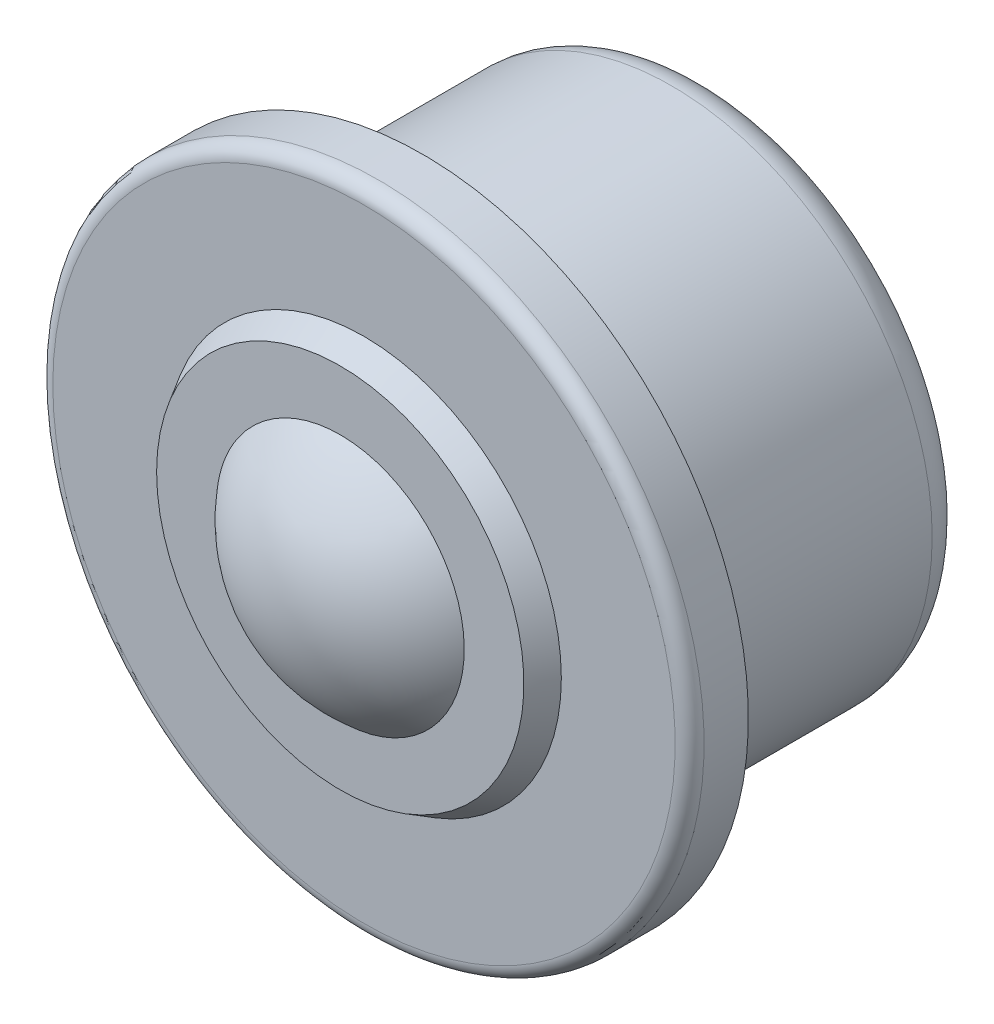
ISO-10303-21;
HEADER;
FILE_DESCRIPTION(('STEP AP214'),'2;1');
FILE_NAME('part.step','',(''),(''),'','','');
FILE_SCHEMA(('AUTOMOTIVE_DESIGN { 1 0 10303 214 1 1 1 1 }'));
ENDSEC;
DATA;
#1=APPLICATION_CONTEXT('core data for automotive mechanical design processes');
#2=APPLICATION_PROTOCOL_DEFINITION('international standard','automotive_design',2000,#1);
#3=PRODUCT_CONTEXT('',#1,'mechanical');
#4=PRODUCT('Part','Part','',(#3));
#5=PRODUCT_RELATED_PRODUCT_CATEGORY('part','',(#4));
#6=PRODUCT_DEFINITION_FORMATION('','',#4);
#7=PRODUCT_DEFINITION_CONTEXT('part definition',#1,'design');
#8=PRODUCT_DEFINITION('design','',#6,#7);
#9=PRODUCT_DEFINITION_SHAPE('','',#8);
#10=(LENGTH_UNIT() NAMED_UNIT(*) SI_UNIT(.MILLI.,.METRE.));
#11=(NAMED_UNIT(*) PLANE_ANGLE_UNIT() SI_UNIT($,.RADIAN.));
#12=(NAMED_UNIT(*) SI_UNIT($,.STERADIAN.) SOLID_ANGLE_UNIT());
#13=UNCERTAINTY_MEASURE_WITH_UNIT(LENGTH_MEASURE(1.E-05),#10,'distance_accuracy_value','');
#14=(GEOMETRIC_REPRESENTATION_CONTEXT(3) GLOBAL_UNCERTAINTY_ASSIGNED_CONTEXT((#13)) GLOBAL_UNIT_ASSIGNED_CONTEXT((#10,
#11,#12)) REPRESENTATION_CONTEXT('',''));
#15=CARTESIAN_POINT('',(0.,0.,0.));
#16=DIRECTION('',(0.,0.,1.));
#17=DIRECTION('',(1.,0.,0.));
#18=AXIS2_PLACEMENT_3D('',#15,#16,#17);
#19=CARTESIAN_POINT('',(0.,0.,-1.19999998087211));
#20=DIRECTION('',(1.,0.,0.));
#21=DIRECTION('',(0.,1.,0.));
#22=AXIS2_PLACEMENT_3D('',#19,#20,#21);
#23=SPHERICAL_SURFACE('',#22,10.9999999867639);
#24=CARTESIAN_POINT('',(-8.56679636578171,0.,5.7));
#25=CARTESIAN_POINT('',(-8.5667980927726,0.240686989194574,5.7));
#26=CARTESIAN_POINT('',(-8.55664892448667,0.481345637660275,5.7));
#27=CARTESIAN_POINT('',(-8.51612310031646,0.96103270341007,5.7));
#28=CARTESIAN_POINT('',(-8.48574112305501,1.20006067510178,5.7));
#29=CARTESIAN_POINT('',(-8.40491488099617,1.67495927640874,5.7));
#30=CARTESIAN_POINT('',(-8.35444920988333,1.91082625869168,5.7));
#31=CARTESIAN_POINT('',(-8.23381496574094,2.37747078518052,5.7));
#32=CARTESIAN_POINT('',(-8.1636461553905,2.60824826804819,5.7));
#33=CARTESIAN_POINT('',(-8.00414451829029,3.06295483504364,5.7));
#34=CARTESIAN_POINT('',(-7.91482113713638,3.28688723269123,5.7));
#35=CARTESIAN_POINT('',(-7.71762360518375,3.72643375455393,5.7));
#36=CARTESIAN_POINT('',(-7.60974916146404,3.94204774735571,5.7));
#37=CARTESIAN_POINT('',(-7.37626788650457,4.36332960347386,5.7));
#38=CARTESIAN_POINT('',(-7.25066869691487,4.56900170199427,5.7));
#39=CARTESIAN_POINT('',(-6.98254890542435,4.96910694620137,5.7));
#40=CARTESIAN_POINT('',(-6.84002246132505,5.16353617694795,5.7));
#41=CARTESIAN_POINT('',(-6.53910776918052,5.53968175816775,5.7));
#42=CARTESIAN_POINT('',(-6.38072072762854,5.72139907383491,5.7));
#43=CARTESIAN_POINT('',(-6.04919916779965,6.0708480101663,5.7));
#44=CARTESIAN_POINT('',(-5.87606441924627,6.23857941236805,5.7));
#45=CARTESIAN_POINT('',(-5.51627675919145,6.55886417473872,5.7));
#46=CARTESIAN_POINT('',(-5.32962357095064,6.71141722403593,5.7));
#47=CARTESIAN_POINT('',(-4.94412489085363,7.00026000508106,5.7));
#48=CARTESIAN_POINT('',(-4.7452791297642,7.13654937750277,5.7));
#49=CARTESIAN_POINT('',(-4.33685429146332,7.3918659666588,5.7));
#50=CARTESIAN_POINT('',(-4.12727739891287,7.51089667818132,5.7));
#51=CARTESIAN_POINT('',(-3.69876837103764,7.73092104501002,5.7));
#52=CARTESIAN_POINT('',(-3.47983302183353,7.83190844120192,5.7));
#53=CARTESIAN_POINT('',(-3.03427276242032,8.01506053474282,5.7));
#54=CARTESIAN_POINT('',(-2.80764926554908,8.0972286704017,5.7));
#55=CARTESIAN_POINT('',(-2.34828226491216,8.24218288418291,5.7));
#56=CARTESIAN_POINT('',(-2.1155386659324,8.30496866056846,5.7));
#57=CARTESIAN_POINT('',(-1.64559355233376,8.41070913986245,5.7));
#58=CARTESIAN_POINT('',(-1.40839211323019,8.45366417838674,5.7));
#59=CARTESIAN_POINT('',(-0.931208502606138,8.51944010015609,5.7));
#60=CARTESIAN_POINT('',(-0.69122626974022,8.54226053836367,5.7));
#61=CARTESIAN_POINT('',(-0.21023721583198,8.56760104720299,5.7));
#62=CARTESIAN_POINT('',(0.0307694064026644,8.5701248916721,5.70000000000001));
#63=CARTESIAN_POINT('',(0.512222262264283,8.55486153016511,5.7));
#64=CARTESIAN_POINT('',(0.752668272977411,8.53706729159761,5.69999999999999));
#65=CARTESIAN_POINT('',(1.23116275026479,8.48128792752323,5.69999999999999));
#66=CARTESIAN_POINT('',(1.46921164167782,8.44330644631576,5.7));
#67=CARTESIAN_POINT('',(1.94126732495833,8.34742412489613,5.7));
#68=CARTESIAN_POINT('',(2.17527405384199,8.28952297459497,5.7));
#69=CARTESIAN_POINT('',(2.6375737893437,8.15421429919541,5.7));
#70=CARTESIAN_POINT('',(2.86586689746376,8.07680712089081,5.7));
#71=CARTESIAN_POINT('',(3.31512571543614,7.90303424913497,5.7));
#72=CARTESIAN_POINT('',(3.53609126321938,7.80666813668131,5.69999999999999));
#73=CARTESIAN_POINT('',(3.96907867790102,7.59568311395381,5.69999999999999));
#74=CARTESIAN_POINT('',(4.18110218703786,7.48106757388135,5.7));
#75=CARTESIAN_POINT('',(4.59481367198839,7.23434274101107,5.7));
#76=CARTESIAN_POINT('',(4.79649804390831,7.10222740508132,5.7));
#77=CARTESIAN_POINT('',(5.18798244932155,6.82149871881538,5.7));
#78=CARTESIAN_POINT('',(5.37778463013103,6.67288836295207,5.7));
#79=CARTESIAN_POINT('',(5.7441980063906,6.36020421439922,5.7));
#80=CARTESIAN_POINT('',(5.92080899647268,6.19613018105223,5.69999999999999));
#81=CARTESIAN_POINT('',(6.25957791163177,5.85369034292158,5.69999999999999));
#82=CARTESIAN_POINT('',(6.42173610686619,5.67532480539883,5.7));
#83=CARTESIAN_POINT('',(6.73045375561549,5.30556321484546,5.7));
#84=CARTESIAN_POINT('',(6.87701286427944,5.11416687389455,5.7));
#85=CARTESIAN_POINT('',(7.15346076591904,4.71974433199582,5.7));
#86=CARTESIAN_POINT('',(7.28335262329569,4.51672027884792,5.7));
#87=CARTESIAN_POINT('',(7.52561652099298,4.10038090332757,5.7));
#88=CARTESIAN_POINT('',(7.6379824756788,3.88706203973839,5.7));
#89=CARTESIAN_POINT('',(7.84432327432396,3.4517531613858,5.7));
#90=CARTESIAN_POINT('',(7.93830131208396,3.22976466050272,5.7));
#91=CARTESIAN_POINT('',(8.10722262920642,2.77865953780393,5.7));
#92=CARTESIAN_POINT('',(8.18216588464953,2.54954290703133,5.7));
#93=CARTESIAN_POINT('',(8.31248373061242,2.08581403292843,5.7));
#94=CARTESIAN_POINT('',(8.36785860232735,1.8512018686199,5.7));
#95=CARTESIAN_POINT('',(8.45864875768908,1.37814016268244,5.7));
#96=CARTESIAN_POINT('',(8.49406349451281,1.13969051610682,5.7));
#97=CARTESIAN_POINT('',(8.54467925431181,0.660655403559458,5.7));
#98=CARTESIAN_POINT('',(8.55988027728708,0.42006993758772,5.7));
#99=CARTESIAN_POINT('',(8.56996040061272,-0.0615197436231701,5.7));
#100=CARTESIAN_POINT('',(8.56484005764389,-0.3025239472107,5.7));
#101=CARTESIAN_POINT('',(8.53431488061966,-0.783247800603466,5.7));
#102=CARTESIAN_POINT('',(8.50890975506376,-1.02296743189904,5.7));
#103=CARTESIAN_POINT('',(8.43799531715856,-1.49941405598202,5.7));
#104=CARTESIAN_POINT('',(8.39248603007231,-1.7361410525296,5.7));
#105=CARTESIAN_POINT('',(8.28167715466172,-2.20496056778932,5.7));
#106=CARTESIAN_POINT('',(8.21637412667664,-2.43705227352525,5.7));
#107=CARTESIAN_POINT('',(8.06647097161469,-2.89482876466326,5.7));
#108=CARTESIAN_POINT('',(7.98187753586838,-3.12051574124365,5.7));
#109=CARTESIAN_POINT('',(7.79396482873663,-3.56400350700186,5.7));
#110=CARTESIAN_POINT('',(7.69064211174948,-3.78180283623902,5.7));
#111=CARTESIAN_POINT('',(7.46601834347977,-4.2079182938631,5.7));
#112=CARTESIAN_POINT('',(7.34471768960566,-4.41623463174176,5.7));
#113=CARTESIAN_POINT('',(7.08499626941382,-4.82191209538812,5.7));
#114=CARTESIAN_POINT('',(6.94657518304938,-5.019273016257,5.7));
#115=CARTESIAN_POINT('',(6.65360109852603,-5.40162929625755,5.7));
#116=CARTESIAN_POINT('',(6.49904835149524,-5.58662484781243,5.7));
#117=CARTESIAN_POINT('',(6.17487847551619,-5.94297092465639,5.7));
#118=CARTESIAN_POINT('',(6.00525862085303,-6.11431897036631,5.7));
#119=CARTESIAN_POINT('',(5.65224600762324,-6.44205732765076,5.7));
#120=CARTESIAN_POINT('',(5.46885803632537,-6.59845279573105,5.7));
#121=CARTESIAN_POINT('',(5.08952586883383,-6.89526904830861,5.7));
#122=CARTESIAN_POINT('',(4.893579362326,-7.03568688023873,5.7));
#123=CARTESIAN_POINT('',(4.49055811474735,-7.29951328241327,5.7));
#124=CARTESIAN_POINT('',(4.2834836197343,-7.42292222853667,5.7));
#125=CARTESIAN_POINT('',(3.85967077551748,-7.65185924205825,5.7));
#126=CARTESIAN_POINT('',(3.64293225457648,-7.75738699153363,5.7));
#127=CARTESIAN_POINT('',(3.20133916182453,-7.94980717787593,5.7));
#128=CARTESIAN_POINT('',(2.97648471641221,-8.03669990482132,5.7));
#129=CARTESIAN_POINT('',(2.52021387468888,-8.19124834785504,5.7));
#130=CARTESIAN_POINT('',(2.28879630129642,-8.25890058890587,5.7));
#131=CARTESIAN_POINT('',(1.821164947785,-8.37444599052304,5.7));
#132=CARTESIAN_POINT('',(1.58495285540247,-8.42234598179784,5.7));
#133=CARTESIAN_POINT('',(1.10928923735243,-8.49808721119983,5.7));
#134=CARTESIAN_POINT('',(0.869837117406162,-8.5259247172759,5.70000000000001));
#135=CARTESIAN_POINT('',(0.389444290904035,-8.56132814052998,5.7));
#136=CARTESIAN_POINT('',(0.148503617366007,-8.56889450573863,5.69999999999998));
#137=CARTESIAN_POINT('',(-0.333162769372863,-8.56370310491807,5.69999999999998));
#138=CARTESIAN_POINT('',(-0.573888478866498,-8.5509449949022,5.7));
#139=CARTESIAN_POINT('',(-1.05340564152086,-8.50519506498972,5.70000000000001));
#140=CARTESIAN_POINT('',(-1.29219712473299,-8.47220356006567,5.7));
#141=CARTESIAN_POINT('',(-1.7661954266735,-8.38621377058864,5.7));
#142=CARTESIAN_POINT('',(-2.00140158184804,-8.33321182827746,5.7));
#143=CARTESIAN_POINT('',(-2.46643113948088,-8.20760044544635,5.7));
#144=CARTESIAN_POINT('',(-2.69625637675291,-8.1349977974952,5.69999999999999));
#145=CARTESIAN_POINT('',(-3.1490209911449,-7.97067612152443,5.69999999999999));
#146=CARTESIAN_POINT('',(-3.37195896222394,-7.87895321931622,5.7));
#147=CARTESIAN_POINT('',(-3.80931033840537,-7.67705433801512,5.7));
#148=CARTESIAN_POINT('',(-4.0237239316999,-7.56687876658086,5.7));
#149=CARTESIAN_POINT('',(-4.44250312380563,-7.32885885650226,5.7));
#150=CARTESIAN_POINT('',(-4.64686892827592,-7.20101487970077,5.7));
#151=CARTESIAN_POINT('',(-5.04410123808007,-6.9285674613203,5.7));
#152=CARTESIAN_POINT('',(-5.23696792294878,-6.78396428150526,5.69999999999999));
#153=CARTESIAN_POINT('',(-5.60984858238342,-6.47901319683888,5.69999999999999));
#154=CARTESIAN_POINT('',(-5.78986157881469,-6.31866409596165,5.7));
#155=CARTESIAN_POINT('',(-6.13567886847487,-5.9834286097687,5.7));
#156=CARTESIAN_POINT('',(-6.30148805670743,-5.80854727390624,5.7));
#157=CARTESIAN_POINT('',(-6.61785744072486,-5.44536368271923,5.7));
#158=CARTESIAN_POINT('',(-6.76841104872273,-5.2570556886813,5.7));
#159=CARTESIAN_POINT('',(-7.05311506187461,-4.86842779932567,5.7));
#160=CARTESIAN_POINT('',(-7.18726572601709,-4.66810809373709,5.7));
#161=CARTESIAN_POINT('',(-7.43827456374257,-4.25677684317358,5.7));
#162=CARTESIAN_POINT('',(-7.55512419280481,-4.04576008380895,5.7));
#163=CARTESIAN_POINT('',(-7.77061884100701,-3.6146315744779,5.7));
#164=CARTESIAN_POINT('',(-7.86926407940815,-3.39451993409305,5.7));
#165=CARTESIAN_POINT('',(-8.0475548027732,-2.94700012348057,5.7));
#166=CARTESIAN_POINT('',(-8.12722045909316,-2.719599993761,5.7));
#167=CARTESIAN_POINT('',(-8.267101435735,-2.25897505322255,5.7));
#168=CARTESIAN_POINT('',(-8.32732186680101,-2.02575179027381,5.7));
#169=CARTESIAN_POINT('',(-8.44043839310834,-1.49643340830745,5.7));
#170=CARTESIAN_POINT('',(-8.48778242043416,-1.19913553955666,5.7));
#171=CARTESIAN_POINT('',(-8.55096032839046,-0.601210380109614,5.7));
#172=CARTESIAN_POINT('',(-8.56679420902093,-0.300583089413359,5.7));
#173=CARTESIAN_POINT('',(-8.56679636578171,0.,5.7));
#174=B_SPLINE_CURVE_WITH_KNOTS('',3,(#24,#25,#26,#27,#28,#29,#30,#31,#32,#33,#34,#35,#36,#37,
#38,#39,#40,#41,#42,#43,#44,#45,#46,#47,#48,#49,#50,#51,#52,#53,#54,#55,#56,#57,#58,#59,#60,#61,
#62,#63,#64,#65,#66,#67,#68,#69,#70,#71,#72,#73,#74,#75,#76,#77,#78,#79,#80,#81,#82,#83,#84,#85,
#86,#87,#88,#89,#90,#91,#92,#93,#94,#95,#96,#97,#98,#99,#100,#101,#102,#103,#104,#105,#106,#107,
#108,#109,#110,#111,#112,#113,#114,#115,#116,#117,#118,#119,#120,#121,#122,#123,#124,#125,#126,
#127,#128,#129,#130,#131,#132,#133,#134,#135,#136,#137,#138,#139,#140,#141,#142,#143,#144,#145,
#146,#147,#148,#149,#150,#151,#152,#153,#154,#155,#156,#157,#158,#159,#160,#161,#162,#163,#164,
#165,#166,#167,#168,#169,#170,#171,#172,#173),.UNSPECIFIED.,.T.,.F.,(4,2,2,2,2,2,2,2,2,2,2,2,2,
2,2,2,2,2,2,2,2,2,2,2,2,2,2,2,2,2,2,2,2,2,2,2,2,2,2,2,2,2,2,2,2,2,2,2,2,2,2,2,2,2,2,2,2,2,2,2,2,
2,2,2,2,2,2,2,2,2,2,2,2,2,4),(0.,0.721798408935903,1.44378673116112,2.16654665850311,
2.88931529173582,3.61172832601559,4.33415276823349,5.05626669854641,5.7786305843445,
6.5009395626229,7.22325982138503,7.94559487112849,8.66794587703469,9.39015040576068,
10.1126049783972,10.834927451914,11.5572611696894,12.2795826622247,13.0019201199187,
13.72412326704,14.4465764623379,15.1688992811391,15.89123334483,16.6135545671931,
17.3358917550291,18.0580957000975,18.7805496942311,19.5028727493601,20.2252070476839,
20.9475278410128,21.6698645994617,22.3920683599253,23.1145223403323,23.8368507259657,
24.5591800192813,25.2814989323956,26.0038376330239,26.7261763336522,27.4484952467665,
28.1708245400822,28.8931529257155,29.6156069061225,30.3378106665861,31.060147425035,
31.7824682183639,32.5048025166877,33.2271255718167,33.9495795659503,34.6717835110187,
35.3941206988547,36.1164419212178,36.8387759849087,37.5610988037098,38.2835519990077,
39.005755146129,39.728092603823,40.4504140963583,41.1727478141338,41.8950702876505,
42.6175248602871,43.3397293890131,44.0620803949193,44.7844154446628,45.5067357034249,
46.2290446817033,46.9514085675014,47.6735224978143,48.3959469400322,49.118359974312,
49.8411286075447,50.5638885348867,51.2858768571119,52.0076752660478,52.9090966366737,
53.8105180072996),.UNSPECIFIED.);
#175=CARTESIAN_POINT('',(-8.56679636578171,0.,5.7));
#176=VERTEX_POINT('',#175);
#177=EDGE_CURVE('E18',#176,#176,#174,.T.);
#178=ORIENTED_EDGE('',*,*,#177,.F.);
#179=EDGE_LOOP('',(#178));
#180=FACE_BOUND('',#179,.T.);
#181=ADVANCED_FACE('F13',(#180),#23,.T.);
#182=CARTESIAN_POINT('',(10.628152785,0.,5.7));
#183=DIRECTION('',(0.,0.,1.));
#184=DIRECTION('',(1.,0.,0.));
#185=AXIS2_PLACEMENT_3D('',#182,#183,#184);
#186=PLANE('',#185);
#187=ORIENTED_EDGE('',*,*,#177,.T.);
#188=EDGE_LOOP('',(#187));
#189=FACE_BOUND('',#188,.T.);
#190=CARTESIAN_POINT('',(0.,0.,5.70000000028325));
#191=DIRECTION('',(0.,0.,-1.));
#192=DIRECTION('',(-1.,0.,0.));
#193=AXIS2_PLACEMENT_3D('',#190,#191,#192);
#194=CIRCLE('',#193,12.6895092004906);
#195=CARTESIAN_POINT('',(-12.6895092004906,0.,5.70000000028325));
#196=VERTEX_POINT('',#195);
#197=EDGE_CURVE('E160',#196,#196,#194,.T.);
#198=ORIENTED_EDGE('',*,*,#197,.F.);
#199=EDGE_LOOP('',(#198));
#200=FACE_BOUND('',#199,.T.);
#201=ADVANCED_FACE('F133',(#189,#200),#186,.T.);
#202=CARTESIAN_POINT('',(2.13215015,0.,-18.32797455));
#203=DIRECTION('',(0.,0.,-1.));
#204=DIRECTION('',(-1.,0.,0.));
#205=AXIS2_PLACEMENT_3D('',#202,#203,#204);
#206=PLANE('',#205);
#207=CARTESIAN_POINT('',(0.,0.,-18.32797455));
#208=DIRECTION('',(0.,0.,1.));
#209=DIRECTION('',(-1.,0.,0.));
#210=AXIS2_PLACEMENT_3D('',#207,#208,#209);
#211=CIRCLE('',#210,4.26430029);
#212=CARTESIAN_POINT('',(-4.26430029,0.,-18.32797455));
#213=VERTEX_POINT('',#212);
#214=EDGE_CURVE('E121',#213,#213,#211,.T.);
#215=ORIENTED_EDGE('',*,*,#214,.F.);
#216=EDGE_LOOP('',(#215));
#217=FACE_BOUND('',#216,.T.);
#218=ADVANCED_FACE('F125',(#217),#206,.T.);
#219=CARTESIAN_POINT('',(0.,0.,4.05999999971675));
#220=DIRECTION('',(0.,0.,-1.));
#221=DIRECTION('',(-1.,0.,0.));
#222=AXIS2_PLACEMENT_3D('',#219,#220,#221);
#223=CONICAL_SURFACE('',#222,13.6363636395094,0.523598774327292);
#224=CARTESIAN_POINT('',(0.,0.,4.05999999971675));
#225=DIRECTION('',(0.,0.,-1.));
#226=DIRECTION('',(-1.,0.,0.));
#227=AXIS2_PLACEMENT_3D('',#224,#225,#226);
#228=CIRCLE('',#227,13.6363636395094);
#229=CARTESIAN_POINT('',(-13.6363636395094,0.,4.05999999971675));
#230=VERTEX_POINT('',#229);
#231=EDGE_CURVE('E81',#230,#230,#228,.T.);
#232=ORIENTED_EDGE('',*,*,#231,.F.);
#233=EDGE_LOOP('',(#232));
#234=FACE_BOUND('',#233,.T.);
#235=ORIENTED_EDGE('',*,*,#197,.T.);
#236=EDGE_LOOP('',(#235));
#237=FACE_BOUND('',#236,.T.);
#238=ADVANCED_FACE('F109',(#234,#237),#223,.T.);
#239=CARTESIAN_POINT('',(0.,0.,-16.8279747152756));
#240=DIRECTION('',(0.,0.,1.));
#241=DIRECTION('',(1.,0.,0.));
#242=AXIS2_PLACEMENT_3D('',#239,#240,#241);
#243=TOROIDAL_SURFACE('',#242,4.26430032803816,1.49999983472437);
#244=ORIENTED_EDGE('',*,*,#214,.T.);
#245=EDGE_LOOP('',(#244));
#246=FACE_BOUND('',#245,.T.);
#247=CARTESIAN_POINT('',(0.,0.,-18.2556869226858));
#248=DIRECTION('',(0.,0.,1.));
#249=DIRECTION('',(1.,0.,0.));
#250=AXIS2_PLACEMENT_3D('',#247,#248,#249);
#251=CIRCLE('',#250,4.72434094086793);
#252=CARTESIAN_POINT('',(4.72434094086793,0.,-18.2556869226858));
#253=VERTEX_POINT('',#252);
#254=EDGE_CURVE('E78',#253,#253,#251,.T.);
#255=ORIENTED_EDGE('',*,*,#254,.F.);
#256=EDGE_LOOP('',(#255));
#257=FACE_BOUND('',#256,.T.);
#258=ADVANCED_FACE('F103',(#246,#257),#243,.T.);
#259=CARTESIAN_POINT('',(17.56818182,0.,4.06));
#260=DIRECTION('',(0.,0.,1.));
#261=DIRECTION('',(1.,0.,0.));
#262=AXIS2_PLACEMENT_3D('',#259,#260,#261);
#263=PLANE('',#262);
#264=ORIENTED_EDGE('',*,*,#231,.T.);
#265=EDGE_LOOP('',(#264));
#266=FACE_BOUND('',#265,.T.);
#267=CARTESIAN_POINT('',(0.,0.,4.06));
#268=DIRECTION('',(0.,0.,-1.));
#269=DIRECTION('',(-1.,0.,0.));
#270=AXIS2_PLACEMENT_3D('',#267,#268,#269);
#271=CIRCLE('',#270,21.5);
#272=CARTESIAN_POINT('',(-21.5,0.,4.06));
#273=VERTEX_POINT('',#272);
#274=EDGE_CURVE('E74',#273,#273,#271,.T.);
#275=ORIENTED_EDGE('',*,*,#274,.F.);
#276=EDGE_LOOP('',(#275));
#277=FACE_BOUND('',#276,.T.);
#278=ADVANCED_FACE('F93',(#266,#277),#263,.T.);
#279=CARTESIAN_POINT('',(0.,0.,-17.0605215273838));
#280=DIRECTION('',(0.,0.,1.));
#281=DIRECTION('',(1.,0.,0.));
#282=AXIS2_PLACEMENT_3D('',#279,#280,#281);
#283=CONICAL_SURFACE('',#282,8.4334749089976,1.25907887918487);
#284=ORIENTED_EDGE('',*,*,#254,.T.);
#285=EDGE_LOOP('',(#284));
#286=FACE_BOUND('',#285,.T.);
#287=CARTESIAN_POINT('',(0.,0.,-17.06052153));
#288=DIRECTION('',(0.,0.,1.));
#289=DIRECTION('',(1.,0.,0.));
#290=AXIS2_PLACEMENT_3D('',#287,#288,#289);
#291=CIRCLE('',#290,8.43347490999999);
#292=CARTESIAN_POINT('',(8.43347490999999,0.,-17.06052153));
#293=VERTEX_POINT('',#292);
#294=EDGE_CURVE('E70',#293,#293,#291,.F.);
#295=ORIENTED_EDGE('',*,*,#294,.T.);
#296=EDGE_LOOP('',(#295));
#297=FACE_BOUND('',#296,.T.);
#298=ADVANCED_FACE('F102',(#286,#297),#283,.T.);
#299=CARTESIAN_POINT('',(0.,0.,3.05999999594886));
#300=DIRECTION('',(0.,0.,1.));
#301=DIRECTION('',(1.,0.,0.));
#302=AXIS2_PLACEMENT_3D('',#299,#300,#301);
#303=TOROIDAL_SURFACE('',#302,21.4999999959489,1.00000000405114);
#304=CARTESIAN_POINT('',(0.,0.,3.06));
#305=DIRECTION('',(0.,0.,-1.));
#306=DIRECTION('',(-1.,0.,0.));
#307=AXIS2_PLACEMENT_3D('',#304,#305,#306);
#308=CIRCLE('',#307,22.5);
#309=CARTESIAN_POINT('',(-22.5,0.,3.06));
#310=VERTEX_POINT('',#309);
#311=EDGE_CURVE('E73',#310,#310,#308,.T.);
#312=ORIENTED_EDGE('',*,*,#311,.F.);
#313=EDGE_LOOP('',(#312));
#314=FACE_BOUND('',#313,.T.);
#315=ORIENTED_EDGE('',*,*,#274,.T.);
#316=EDGE_LOOP('',(#315));
#317=FACE_BOUND('',#316,.T.);
#318=ADVANCED_FACE('F60',(#314,#317),#303,.T.);
#319=CARTESIAN_POINT('',(0.,0.,-18.4882339195689));
#320=DIRECTION('',(0.,0.,1.));
#321=DIRECTION('',(1.,0.,0.));
#322=AXIS2_PLACEMENT_3D('',#319,#320,#321);
#323=TOROIDAL_SURFACE('',#322,8.89351555539516,1.50000002091475);
#324=ORIENTED_EDGE('',*,*,#294,.F.);
#325=EDGE_LOOP('',(#324));
#326=FACE_BOUND('',#325,.T.);
#327=CARTESIAN_POINT('',(0.,0.,-17.1335328868519));
#328=DIRECTION('',(0.,0.,-1.));
#329=DIRECTION('',(1.,0.,0.));
#330=AXIS2_PLACEMENT_3D('',#327,#328,#329);
#331=CIRCLE('',#330,9.53755374149662);
#332=CARTESIAN_POINT('',(9.53755374149662,0.,-17.1335328868519));
#333=VERTEX_POINT('',#332);
#334=EDGE_CURVE('E153',#333,#333,#331,.T.);
#335=ORIENTED_EDGE('',*,*,#334,.T.);
#336=EDGE_LOOP('',(#335));
#337=FACE_BOUND('',#336,.T.);
#338=ADVANCED_FACE('F55',(#326,#337),#323,.F.);
#339=CARTESIAN_POINT('',(0.,0.,1.53));
#340=DIRECTION('',(0.,0.,-1.));
#341=DIRECTION('',(-1.,0.,0.));
#342=AXIS2_PLACEMENT_3D('',#339,#340,#341);
#343=CYLINDRICAL_SURFACE('',#342,22.5);
#344=CARTESIAN_POINT('',(0.,0.,0.));
#345=DIRECTION('',(0.,0.,-1.));
#346=DIRECTION('',(-1.,0.,0.));
#347=AXIS2_PLACEMENT_3D('',#344,#345,#346);
#348=CIRCLE('',#347,22.5);
#349=CARTESIAN_POINT('',(-22.5,0.,0.));
#350=VERTEX_POINT('',#349);
#351=EDGE_CURVE('E152',#350,#350,#348,.T.);
#352=ORIENTED_EDGE('',*,*,#351,.F.);
#353=EDGE_LOOP('',(#352));
#354=FACE_BOUND('',#353,.T.);
#355=ORIENTED_EDGE('',*,*,#311,.T.);
#356=EDGE_LOOP('',(#355));
#357=FACE_BOUND('',#356,.T.);
#358=ADVANCED_FACE('F51',(#354,#357),#343,.T.);
#359=CARTESIAN_POINT('',(0.,0.,-19.4578350131481));
#360=DIRECTION('',(0.,0.,-1.));
#361=DIRECTION('',(-1.,0.,0.));
#362=AXIS2_PLACEMENT_3D('',#359,#360,#361);
#363=CONICAL_SURFACE('',#362,14.4266030285034,1.1270136530036);
#364=CARTESIAN_POINT('',(0.,0.,-19.45783501));
#365=DIRECTION('',(0.,0.,1.));
#366=DIRECTION('',(1.,0.,0.));
#367=AXIS2_PLACEMENT_3D('',#364,#365,#366);
#368=CIRCLE('',#367,14.42660303);
#369=CARTESIAN_POINT('',(14.42660303,0.,-19.45783501));
#370=VERTEX_POINT('',#369);
#371=EDGE_CURVE('E29',#370,#370,#368,.T.);
#372=ORIENTED_EDGE('',*,*,#371,.F.);
#373=EDGE_LOOP('',(#372));
#374=FACE_BOUND('',#373,.T.);
#375=ORIENTED_EDGE('',*,*,#334,.F.);
#376=EDGE_LOOP('',(#375));
#377=FACE_BOUND('',#376,.T.);
#378=ADVANCED_FACE('F47',(#374,#377),#363,.F.);
#379=CARTESIAN_POINT('',(20.25,0.,0.));
#380=DIRECTION('',(0.,0.,-1.));
#381=DIRECTION('',(-1.,0.,0.));
#382=AXIS2_PLACEMENT_3D('',#379,#380,#381);
#383=PLANE('',#382);
#384=CARTESIAN_POINT('',(0.,0.,0.));
#385=DIRECTION('',(0.,0.,-1.));
#386=DIRECTION('',(-1.,0.,0.));
#387=AXIS2_PLACEMENT_3D('',#384,#385,#386);
#388=CIRCLE('',#387,18.);
#389=CARTESIAN_POINT('',(-18.,0.,0.));
#390=VERTEX_POINT('',#389);
#391=EDGE_CURVE('E24',#390,#390,#388,.T.);
#392=ORIENTED_EDGE('',*,*,#391,.F.);
#393=EDGE_LOOP('',(#392));
#394=FACE_BOUND('',#393,.T.);
#395=ORIENTED_EDGE('',*,*,#351,.T.);
#396=EDGE_LOOP('',(#395));
#397=FACE_BOUND('',#396,.T.);
#398=ADVANCED_FACE('F43',(#394,#397),#383,.T.);
#399=CARTESIAN_POINT('',(0.,0.,-17.200000008292));
#400=DIRECTION('',(0.,0.,1.));
#401=DIRECTION('',(1.,0.,0.));
#402=AXIS2_PLACEMENT_3D('',#399,#400,#401);
#403=TOROIDAL_SURFACE('',#402,15.5000000069762,2.49999999302383);
#404=ORIENTED_EDGE('',*,*,#371,.T.);
#405=EDGE_LOOP('',(#404));
#406=FACE_BOUND('',#405,.T.);
#407=CARTESIAN_POINT('',(0.,0.,-17.2));
#408=DIRECTION('',(0.,0.,-1.));
#409=DIRECTION('',(-1.,0.,0.));
#410=AXIS2_PLACEMENT_3D('',#407,#408,#409);
#411=CIRCLE('',#410,18.);
#412=CARTESIAN_POINT('',(-18.,0.,-17.2));
#413=VERTEX_POINT('',#412);
#414=EDGE_CURVE('E9',#413,#413,#411,.F.);
#415=ORIENTED_EDGE('',*,*,#414,.F.);
#416=EDGE_LOOP('',(#415));
#417=FACE_BOUND('',#416,.T.);
#418=ADVANCED_FACE('F38',(#406,#417),#403,.T.);
#419=CARTESIAN_POINT('',(0.,0.,-8.6));
#420=DIRECTION('',(0.,0.,-1.));
#421=DIRECTION('',(-1.,0.,0.));
#422=AXIS2_PLACEMENT_3D('',#419,#420,#421);
#423=CYLINDRICAL_SURFACE('',#422,18.);
#424=ORIENTED_EDGE('',*,*,#414,.T.);
#425=EDGE_LOOP('',(#424));
#426=FACE_BOUND('',#425,.T.);
#427=ORIENTED_EDGE('',*,*,#391,.T.);
#428=EDGE_LOOP('',(#427));
#429=FACE_BOUND('',#428,.T.);
#430=ADVANCED_FACE('F42',(#426,#429),#423,.T.);
#431=CLOSED_SHELL('',(#181,#201,#218,#238,#258,#278,#298,#318,#338,#358,#378,#398,#418,#430));
#432=MANIFOLD_SOLID_BREP('B1',#431);
#433=ADVANCED_BREP_SHAPE_REPRESENTATION('',(#18,#432),#14);
#434=SHAPE_DEFINITION_REPRESENTATION(#9,#433);
ENDSEC;
END-ISO-10303-21;
